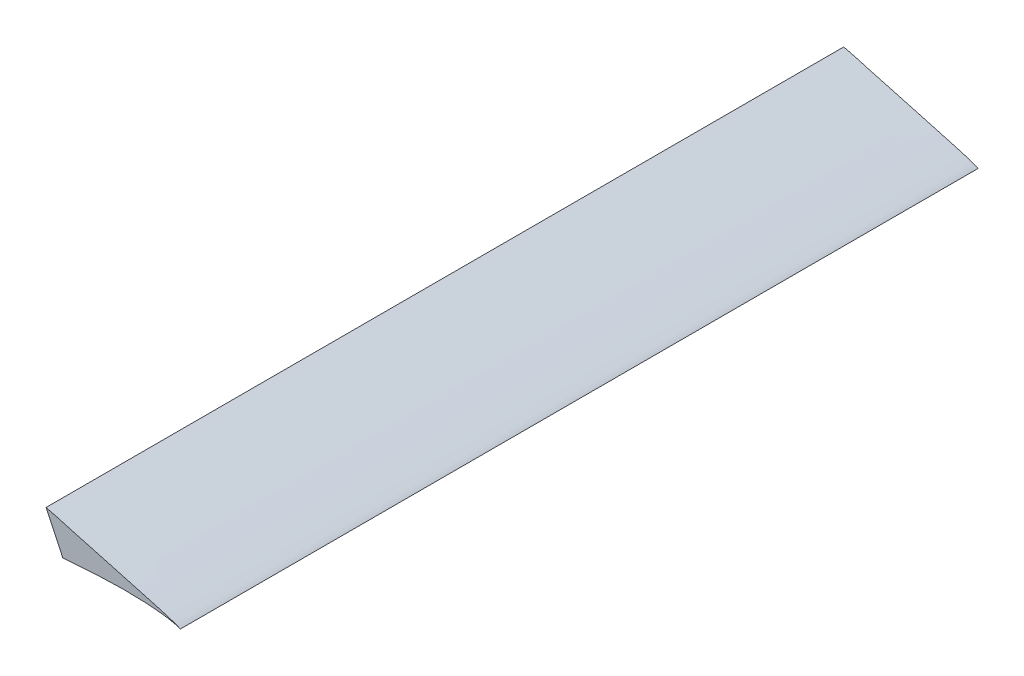
ISO-10303-21;
HEADER;
FILE_DESCRIPTION(('STEP AP214'),'2;1');
FILE_NAME('part.step','',(''),(''),'','','');
FILE_SCHEMA(('AUTOMOTIVE_DESIGN { 1 0 10303 214 1 1 1 1 }'));
ENDSEC;
DATA;
#1=APPLICATION_CONTEXT('core data for automotive mechanical design processes');
#2=APPLICATION_PROTOCOL_DEFINITION('international standard','automotive_design',2000,#1);
#3=PRODUCT_CONTEXT('',#1,'mechanical');
#4=PRODUCT('Part','Part','',(#3));
#5=PRODUCT_RELATED_PRODUCT_CATEGORY('part','',(#4));
#6=PRODUCT_DEFINITION_FORMATION('','',#4);
#7=PRODUCT_DEFINITION_CONTEXT('part definition',#1,'design');
#8=PRODUCT_DEFINITION('design','',#6,#7);
#9=PRODUCT_DEFINITION_SHAPE('','',#8);
#10=(LENGTH_UNIT() NAMED_UNIT(*) SI_UNIT(.MILLI.,.METRE.));
#11=(NAMED_UNIT(*) PLANE_ANGLE_UNIT() SI_UNIT($,.RADIAN.));
#12=(NAMED_UNIT(*) SI_UNIT($,.STERADIAN.) SOLID_ANGLE_UNIT());
#13=UNCERTAINTY_MEASURE_WITH_UNIT(LENGTH_MEASURE(1.E-05),#10,'distance_accuracy_value','');
#14=(GEOMETRIC_REPRESENTATION_CONTEXT(3) GLOBAL_UNCERTAINTY_ASSIGNED_CONTEXT((#13)) GLOBAL_UNIT_ASSIGNED_CONTEXT((#10,
#11,#12)) REPRESENTATION_CONTEXT('',''));
#15=CARTESIAN_POINT('',(0.,0.,0.));
#16=DIRECTION('',(0.,0.,1.));
#17=DIRECTION('',(1.,0.,0.));
#18=AXIS2_PLACEMENT_3D('',#15,#16,#17);
#19=CARTESIAN_POINT('',(252.080803760384,120.091997464376,754.38));
#20=DIRECTION('',(0.902786104260496,0.430089816147927,0.));
#21=DIRECTION('',(-0.430089816147927,0.902786104260496,0.));
#22=AXIS2_PLACEMENT_3D('',#19,#20,#21);
#23=PLANE('',#22);
#24=DIRECTION('',(0.430089816147927,-0.902786104260496,0.));
#25=VECTOR('',#24,1.);
#26=CARTESIAN_POINT('',(252.080803760384,120.091997464376,0.));
#27=LINE('',#26,#25);
#28=CARTESIAN_POINT('',(292.1,36.0891382653728,0.));
#29=VERTEX_POINT('',#28);
#30=CARTESIAN_POINT('',(307.975,2.76649525676335,0.));
#31=VERTEX_POINT('',#30);
#32=EDGE_CURVE('E74',#29,#31,#27,.T.);
#33=ORIENTED_EDGE('',*,*,#32,.T.);
#34=DIRECTION('',(0.,0.,-1.));
#35=VECTOR('',#34,1.);
#36=CARTESIAN_POINT('',(307.975,2.76649525676335,754.38));
#37=LINE('',#36,#35);
#38=CARTESIAN_POINT('',(307.975,2.76649525676335,754.38));
#39=VERTEX_POINT('',#38);
#40=EDGE_CURVE('E11',#39,#31,#37,.T.);
#41=ORIENTED_EDGE('',*,*,#40,.F.);
#42=DIRECTION('',(0.430089816147927,-0.902786104260496,0.));
#43=VECTOR('',#42,1.);
#44=CARTESIAN_POINT('',(252.080803760384,120.091997464376,754.38));
#45=LINE('',#44,#43);
#46=CARTESIAN_POINT('',(292.1,36.0891382653728,754.38));
#47=VERTEX_POINT('',#46);
#48=EDGE_CURVE('E73',#47,#39,#45,.T.);
#49=ORIENTED_EDGE('',*,*,#48,.F.);
#50=DIRECTION('',(0.,0.,-1.));
#51=VECTOR('',#50,1.);
#52=CARTESIAN_POINT('',(292.1,36.0891382653728,754.38));
#53=LINE('',#52,#51);
#54=EDGE_CURVE('E50',#47,#29,#53,.T.);
#55=ORIENTED_EDGE('',*,*,#54,.T.);
#56=EDGE_LOOP('',(#33,#41,#49,#55));
#57=FACE_BOUND('',#56,.T.);
#58=ADVANCED_FACE('F41',(#57),#23,.F.);
#59=CARTESIAN_POINT('',(419.1,0.,754.38));
#60=CARTESIAN_POINT('',(419.135582715604,0.0308317196044877,754.38));
#61=CARTESIAN_POINT('',(415.908005576762,1.68017552922438,754.38));
#62=CARTESIAN_POINT('',(413.243760321431,2.45449325102642,754.38));
#63=CARTESIAN_POINT('',(409.043286393216,3.88399929072975,754.38));
#64=CARTESIAN_POINT('',(404.448084399841,5.26468352260066,754.38));
#65=CARTESIAN_POINT('',(399.073048504437,6.84672085309653,754.38));
#66=CARTESIAN_POINT('',(393.069943473864,8.55383071372093,754.38));
#67=CARTESIAN_POINT('',(386.416537762572,10.4125623702694,754.38));
#68=CARTESIAN_POINT('',(379.149346257583,12.4152401973134,754.38));
#69=CARTESIAN_POINT('',(371.290373604248,14.5663386528226,754.38));
#70=CARTESIAN_POINT('',(362.867607833606,16.8600771410093,754.38));
#71=CARTESIAN_POINT('',(353.911264701423,19.2970964213392,754.38));
#72=CARTESIAN_POINT('',(344.453150457147,21.8730071850554,754.38));
#73=CARTESIAN_POINT('',(334.523432326998,24.5698824655877,754.38));
#74=CARTESIAN_POINT('',(324.169303454509,27.4216021936468,754.38));
#75=CARTESIAN_POINT('',(313.362731470659,30.2499142733887,754.38));
#76=CARTESIAN_POINT('',(302.362905014892,33.694567181203,754.38));
#77=CARTESIAN_POINT('',(290.812066152157,36.3225036594668,754.38));
#78=CARTESIAN_POINT('',(279.147802785444,39.4898304897028,754.38));
#79=CARTESIAN_POINT('',(267.18702760258,42.4092459803584,754.38));
#80=CARTESIAN_POINT('',(255.034690470087,45.1684284186771,754.38));
#81=CARTESIAN_POINT('',(242.721185390446,47.650209376373,754.38));
#82=CARTESIAN_POINT('',(230.296228943543,49.8338945911509,754.38));
#83=CARTESIAN_POINT('',(217.801864374593,51.6800065771285,754.38));
#84=CARTESIAN_POINT('',(205.28400048705,53.175668630729,754.38));
#85=CARTESIAN_POINT('',(192.786307767397,54.3071055161748,754.38));
#86=CARTESIAN_POINT('',(180.35248832563,55.0551537512211,754.38));
#87=CARTESIAN_POINT('',(168.027001927048,55.4190185344547,754.38));
#88=CARTESIAN_POINT('',(155.853682433519,55.4157048874246,754.38));
#89=CARTESIAN_POINT('',(143.874848820048,55.0431886057995,754.38));
#90=CARTESIAN_POINT('',(132.132886757781,54.3128726201629,754.38));
#91=CARTESIAN_POINT('',(120.667074019597,53.2411304735398,754.38));
#92=CARTESIAN_POINT('',(109.522615963792,51.8022144959764,754.38));
#93=CARTESIAN_POINT('',(98.7372141186955,50.0463241889842,754.38));
#94=CARTESIAN_POINT('',(88.3471013961049,48.018984454137,754.38));
#95=CARTESIAN_POINT('',(78.3889033747344,45.7522950434563,754.38));
#96=CARTESIAN_POINT('',(68.8976027410483,43.2760726247493,754.38));
#97=CARTESIAN_POINT('',(59.9067725274482,40.6169839418443,754.38));
#98=CARTESIAN_POINT('',(51.4478081121291,37.8028434738782,754.38));
#99=CARTESIAN_POINT('',(43.5499195166549,34.8620258650089,754.38));
#100=CARTESIAN_POINT('',(36.2412767191211,31.8209315950195,754.38));
#101=CARTESIAN_POINT('',(29.5472205514253,28.7079086552229,754.38));
#102=CARTESIAN_POINT('',(23.4899755011858,25.5532333371454,754.38));
#103=CARTESIAN_POINT('',(18.0911782238622,22.3841442181796,754.38));
#104=CARTESIAN_POINT('',(13.3658843805296,19.2305326996037,754.38));
#105=CARTESIAN_POINT('',(9.3302502078457,16.1138179845186,754.38));
#106=CARTESIAN_POINT('',(5.96985195064272,13.0389997626468,754.38));
#107=CARTESIAN_POINT('',(3.34519775435926,9.93858431084437,754.38));
#108=CARTESIAN_POINT('',(1.18019279694968,6.53570814186339,754.38));
#109=CARTESIAN_POINT('',(0.479614476084666,3.07990840614629,754.38));
#110=CARTESIAN_POINT('',(-0.173094538194013,-0.266173519096999,754.38));
#111=CARTESIAN_POINT('',(0.240253696731487,-3.33294292892219,754.38));
#112=CARTESIAN_POINT('',(1.37823066344816,-6.42381349893486,754.38));
#113=CARTESIAN_POINT('',(3.22917605316422,-9.15021189114401,754.38));
#114=CARTESIAN_POINT('',(5.89603945867697,-11.3206783893859,754.38));
#115=CARTESIAN_POINT('',(9.37076014042797,-12.5914230643237,754.38));
#116=CARTESIAN_POINT('',(13.453435798726,-13.2083059619907,754.38));
#117=CARTESIAN_POINT('',(18.1779423005279,-13.5437135880216,754.38));
#118=CARTESIAN_POINT('',(23.5691170669731,-13.7123319803595,754.38));
#119=CARTESIAN_POINT('',(29.6182619801359,-13.823243232534,754.38));
#120=CARTESIAN_POINT('',(36.3042180587839,-13.6335103430087,754.38));
#121=CARTESIAN_POINT('',(43.6073655350185,-13.7495169210751,754.38));
#122=CARTESIAN_POINT('',(51.4990776759717,-13.5704792834039,754.38));
#123=CARTESIAN_POINT('',(59.9532183473222,-13.4254465725169,754.38));
#124=CARTESIAN_POINT('',(68.9395115321997,-13.2237173628326,754.38));
#125=CARTESIAN_POINT('',(78.4265430004961,-12.9981677083409,754.38));
#126=CARTESIAN_POINT('',(88.3808800346853,-12.7416794666378,754.38));
#127=CARTESIAN_POINT('',(98.7673540895394,-12.4570310641555,754.38));
#128=CARTESIAN_POINT('',(109.54948172432,-12.140459652531,754.38));
#129=CARTESIAN_POINT('',(120.689292624668,-11.7887582713286,754.38));
#130=CARTESIAN_POINT('',(132.147836588957,-11.3961109222143,754.38));
#131=CARTESIAN_POINT('',(143.884459540584,-10.9535138146728,754.38));
#132=CARTESIAN_POINT('',(155.858263106315,-10.4528030476575,754.38));
#133=CARTESIAN_POINT('',(168.027206140478,-9.86999068905553,754.38));
#134=CARTESIAN_POINT('',(180.347887972849,-9.165777546511,754.38));
#135=CARTESIAN_POINT('',(192.776520036076,-8.32898473292583,754.38));
#136=CARTESIAN_POINT('',(205.26997993133,-7.36712520311923,754.38));
#137=CARTESIAN_POINT('',(217.78370517201,-6.28359723526979,754.38));
#138=CARTESIAN_POINT('',(230.27340567155,-5.08810592291552,754.38));
#139=CARTESIAN_POINT('',(242.694431579561,-3.80572861400042,754.38));
#140=CARTESIAN_POINT('',(255.00369846204,-2.48473779902352,754.38));
#141=CARTESIAN_POINT('',(267.1595145786,-1.18392896216685,754.38));
#142=CARTESIAN_POINT('',(279.118910189508,0.0608541103189656,754.38));
#143=CARTESIAN_POINT('',(290.839416131453,1.22547415877869,754.38));
#144=CARTESIAN_POINT('',(302.279388868877,2.28931437619538,754.38));
#145=CARTESIAN_POINT('',(313.398970817434,3.22922123297632,754.38));
#146=CARTESIAN_POINT('',(324.158839538699,4.03315524687126,754.38));
#147=CARTESIAN_POINT('',(334.521417810108,4.68459136287556,754.38));
#148=CARTESIAN_POINT('',(344.449906703923,5.17915941725161,754.38));
#149=CARTESIAN_POINT('',(353.909457193007,5.50145282981024,754.38));
#150=CARTESIAN_POINT('',(362.866468874944,5.68255660990501,754.38));
#151=CARTESIAN_POINT('',(371.289861146006,5.66136185236058,754.38));
#152=CARTESIAN_POINT('',(379.150044793554,5.50730755128629,754.38));
#153=CARTESIAN_POINT('',(386.41801209807,5.19545299038324,754.38));
#154=CARTESIAN_POINT('',(393.072269135646,4.74663009471408,754.38));
#155=CARTESIAN_POINT('',(399.076807101172,4.17945925926168,754.38));
#156=CARTESIAN_POINT('',(404.450455267835,3.48998403896945,754.38));
#157=CARTESIAN_POINT('',(409.051278482858,2.78398441205405,754.38));
#158=CARTESIAN_POINT('',(413.236952463653,1.83700723232058,754.38));
#159=CARTESIAN_POINT('',(415.921101733839,1.37110704301137,754.38));
#160=CARTESIAN_POINT('',(419.065830525278,-0.029607174319721,754.38));
#161=CARTESIAN_POINT('',(419.1,0.,754.38));
#162=B_SPLINE_CURVE_WITH_KNOTS('',3,(#59,#60,#61,#62,#63,#64,#65,#66,#67,#68,#69,#70,#71,#72,
#73,#74,#75,#76,#77,#78,#79,#80,#81,#82,#83,#84,#85,#86,#87,#88,#89,#90,#91,#92,#93,#94,#95,#96,
#97,#98,#99,#100,#101,#102,#103,#104,#105,#106,#107,#108,#109,#110,#111,#112,#113,#114,#115,
#116,#117,#118,#119,#120,#121,#122,#123,#124,#125,#126,#127,#128,#129,#130,#131,#132,#133,#134,
#135,#136,#137,#138,#139,#140,#141,#142,#143,#144,#145,#146,#147,#148,#149,#150,#151,#152,#153,
#154,#155,#156,#157,#158,#159,#160,#161),.UNSPECIFIED.,.T.,.F.,(4,1,1,1,1,1,1,1,1,1,1,1,1,1,1,1,
1,1,1,1,1,1,1,1,1,1,1,1,1,1,1,1,1,1,1,1,1,1,1,1,1,1,1,1,1,1,1,1,1,1,1,1,1,1,1,1,1,1,1,1,1,1,1,1,
1,1,1,1,1,1,1,1,1,1,1,1,1,1,1,1,1,1,1,1,1,1,1,1,1,1,1,1,1,1,1,1,1,1,1,1,4),(0.,
0.00326326473849562,0.00725055778081695,0.0120517866669423,0.0176623330327685,
0.0240683135255837,0.0312496964611172,0.0391846495195136,0.0478476383038653,0.0572106956853794,
0.0672423330052171,0.0779087597757613,0.0891739845115157,0.100998598535301,0.113341295445461,
0.126157183269471,0.139462308480939,0.15301104004999,0.166927614873976,0.181081999654676,
0.195404479567021,0.209838051098696,0.22433260533195,0.238841948726956,0.253325072610518,
0.267739981910177,0.282048685133404,0.296212776873056,0.310196042923521,0.323962314217842,
0.337476234648746,0.350702494836571,0.363610632106416,0.376163958841249,0.388325705275646,
0.400058825783343,0.411327389676265,0.422098222191528,0.43233946020634,0.442020270803025,
0.451113162537921,0.459592207108775,0.467434958693347,0.474622153537792,0.481140130111015,
0.486983093720853,0.492171114209171,0.496782496001346,0.500970225910245,0.505871632390465,
0.508789423353898,0.512670174112342,0.516325667709443,0.520069901737776,0.523879651231969,
0.52796074283848,0.532641784179838,0.53806925539385,0.544264221299989,0.551214848194982,
0.558899644744671,0.567291448215615,0.576362098792024,0.586079537161936,0.59640911206805,
0.607314709370189,0.618758331538551,0.630699137504577,0.643094929182506,0.655903572744297,
0.669079202119925,0.682576600267353,0.696348372587692,0.710348009169474,0.724529115657972,
0.738844326830719,0.753243364933569,0.767678182352391,0.782097111011908,0.796448880119002,
0.810678262943487,0.824728612910585,0.838547558662397,0.852083943216766,0.865287848030887,
0.878111787127333,0.890511304117214,0.902443005266515,0.913865891429004,0.924742045614225,
0.935035830895632,0.944714495449492,0.953747111862331,0.962105881416277,0.969765452086777,
0.97670305026236,0.982898839006144,0.988333205705569,0.992993711919812,0.996866342545812,1.),.UNSPECIFIED.);
#163=DIRECTION('',(0.,0.,-1.));
#164=VECTOR('',#163,1.);
#165=SURFACE_OF_LINEAR_EXTRUSION('',#162,#164);
#166=CARTESIAN_POINT('',(419.1,0.,0.));
#167=CARTESIAN_POINT('',(419.135582715604,0.0308317196044877,0.));
#168=CARTESIAN_POINT('',(415.908005576762,1.68017552922438,0.));
#169=CARTESIAN_POINT('',(413.243760321431,2.45449325102642,0.));
#170=CARTESIAN_POINT('',(409.043286393216,3.88399929072975,0.));
#171=CARTESIAN_POINT('',(404.448084399841,5.26468352260066,0.));
#172=CARTESIAN_POINT('',(399.073048504437,6.84672085309653,0.));
#173=CARTESIAN_POINT('',(393.069943473864,8.55383071372093,0.));
#174=CARTESIAN_POINT('',(386.416537762572,10.4125623702694,0.));
#175=CARTESIAN_POINT('',(379.149346257583,12.4152401973134,0.));
#176=CARTESIAN_POINT('',(371.290373604248,14.5663386528226,0.));
#177=CARTESIAN_POINT('',(362.867607833606,16.8600771410093,0.));
#178=CARTESIAN_POINT('',(353.911264701423,19.2970964213392,0.));
#179=CARTESIAN_POINT('',(344.453150457147,21.8730071850554,0.));
#180=CARTESIAN_POINT('',(334.523432326998,24.5698824655877,0.));
#181=CARTESIAN_POINT('',(324.169303454509,27.4216021936468,0.));
#182=CARTESIAN_POINT('',(313.362731470659,30.2499142733887,0.));
#183=CARTESIAN_POINT('',(302.362905014892,33.694567181203,0.));
#184=CARTESIAN_POINT('',(290.812066152157,36.3225036594668,0.));
#185=CARTESIAN_POINT('',(279.147802785444,39.4898304897028,0.));
#186=CARTESIAN_POINT('',(267.18702760258,42.4092459803584,0.));
#187=CARTESIAN_POINT('',(255.034690470087,45.1684284186771,0.));
#188=CARTESIAN_POINT('',(242.721185390446,47.650209376373,0.));
#189=CARTESIAN_POINT('',(230.296228943543,49.8338945911509,0.));
#190=CARTESIAN_POINT('',(217.801864374593,51.6800065771285,0.));
#191=CARTESIAN_POINT('',(205.28400048705,53.175668630729,0.));
#192=CARTESIAN_POINT('',(192.786307767397,54.3071055161748,0.));
#193=CARTESIAN_POINT('',(180.35248832563,55.0551537512211,0.));
#194=CARTESIAN_POINT('',(168.027001927048,55.4190185344547,0.));
#195=CARTESIAN_POINT('',(155.853682433519,55.4157048874246,0.));
#196=CARTESIAN_POINT('',(143.874848820048,55.0431886057995,0.));
#197=CARTESIAN_POINT('',(132.132886757781,54.3128726201629,0.));
#198=CARTESIAN_POINT('',(120.667074019597,53.2411304735398,0.));
#199=CARTESIAN_POINT('',(109.522615963792,51.8022144959764,0.));
#200=CARTESIAN_POINT('',(98.7372141186955,50.0463241889842,0.));
#201=CARTESIAN_POINT('',(88.3471013961049,48.018984454137,0.));
#202=CARTESIAN_POINT('',(78.3889033747344,45.7522950434563,0.));
#203=CARTESIAN_POINT('',(68.8976027410483,43.2760726247493,0.));
#204=CARTESIAN_POINT('',(59.9067725274482,40.6169839418443,0.));
#205=CARTESIAN_POINT('',(51.4478081121291,37.8028434738782,0.));
#206=CARTESIAN_POINT('',(43.5499195166549,34.8620258650089,0.));
#207=CARTESIAN_POINT('',(36.2412767191211,31.8209315950195,0.));
#208=CARTESIAN_POINT('',(29.5472205514253,28.7079086552229,0.));
#209=CARTESIAN_POINT('',(23.4899755011858,25.5532333371454,0.));
#210=CARTESIAN_POINT('',(18.0911782238622,22.3841442181796,0.));
#211=CARTESIAN_POINT('',(13.3658843805296,19.2305326996037,0.));
#212=CARTESIAN_POINT('',(9.3302502078457,16.1138179845186,0.));
#213=CARTESIAN_POINT('',(5.96985195064272,13.0389997626468,0.));
#214=CARTESIAN_POINT('',(3.34519775435926,9.93858431084437,0.));
#215=CARTESIAN_POINT('',(1.18019279694968,6.53570814186339,0.));
#216=CARTESIAN_POINT('',(0.479614476084666,3.07990840614629,0.));
#217=CARTESIAN_POINT('',(-0.173094538194013,-0.266173519096999,0.));
#218=CARTESIAN_POINT('',(0.240253696731487,-3.33294292892219,0.));
#219=CARTESIAN_POINT('',(1.37823066344816,-6.42381349893486,0.));
#220=CARTESIAN_POINT('',(3.22917605316422,-9.15021189114401,0.));
#221=CARTESIAN_POINT('',(5.89603945867697,-11.3206783893859,0.));
#222=CARTESIAN_POINT('',(9.37076014042797,-12.5914230643237,0.));
#223=CARTESIAN_POINT('',(13.453435798726,-13.2083059619907,0.));
#224=CARTESIAN_POINT('',(18.1779423005279,-13.5437135880216,0.));
#225=CARTESIAN_POINT('',(23.5691170669731,-13.7123319803595,0.));
#226=CARTESIAN_POINT('',(29.6182619801359,-13.823243232534,0.));
#227=CARTESIAN_POINT('',(36.3042180587839,-13.6335103430087,0.));
#228=CARTESIAN_POINT('',(43.6073655350185,-13.7495169210751,0.));
#229=CARTESIAN_POINT('',(51.4990776759717,-13.5704792834039,0.));
#230=CARTESIAN_POINT('',(59.9532183473222,-13.4254465725169,0.));
#231=CARTESIAN_POINT('',(68.9395115321997,-13.2237173628326,0.));
#232=CARTESIAN_POINT('',(78.4265430004961,-12.9981677083409,0.));
#233=CARTESIAN_POINT('',(88.3808800346853,-12.7416794666378,0.));
#234=CARTESIAN_POINT('',(98.7673540895394,-12.4570310641555,0.));
#235=CARTESIAN_POINT('',(109.54948172432,-12.140459652531,0.));
#236=CARTESIAN_POINT('',(120.689292624668,-11.7887582713286,0.));
#237=CARTESIAN_POINT('',(132.147836588957,-11.3961109222143,0.));
#238=CARTESIAN_POINT('',(143.884459540584,-10.9535138146728,0.));
#239=CARTESIAN_POINT('',(155.858263106315,-10.4528030476575,0.));
#240=CARTESIAN_POINT('',(168.027206140478,-9.86999068905553,0.));
#241=CARTESIAN_POINT('',(180.347887972849,-9.165777546511,0.));
#242=CARTESIAN_POINT('',(192.776520036076,-8.32898473292583,0.));
#243=CARTESIAN_POINT('',(205.26997993133,-7.36712520311923,0.));
#244=CARTESIAN_POINT('',(217.78370517201,-6.28359723526979,0.));
#245=CARTESIAN_POINT('',(230.27340567155,-5.08810592291552,0.));
#246=CARTESIAN_POINT('',(242.694431579561,-3.80572861400042,0.));
#247=CARTESIAN_POINT('',(255.00369846204,-2.48473779902352,0.));
#248=CARTESIAN_POINT('',(267.1595145786,-1.18392896216685,0.));
#249=CARTESIAN_POINT('',(279.118910189508,0.0608541103189656,0.));
#250=CARTESIAN_POINT('',(290.839416131453,1.22547415877869,0.));
#251=CARTESIAN_POINT('',(302.279388868877,2.28931437619538,0.));
#252=CARTESIAN_POINT('',(313.398970817434,3.22922123297632,0.));
#253=CARTESIAN_POINT('',(324.158839538699,4.03315524687126,0.));
#254=CARTESIAN_POINT('',(334.521417810108,4.68459136287556,0.));
#255=CARTESIAN_POINT('',(344.449906703923,5.17915941725161,0.));
#256=CARTESIAN_POINT('',(353.909457193007,5.50145282981024,0.));
#257=CARTESIAN_POINT('',(362.866468874944,5.68255660990501,0.));
#258=CARTESIAN_POINT('',(371.289861146006,5.66136185236058,0.));
#259=CARTESIAN_POINT('',(379.150044793554,5.50730755128629,0.));
#260=CARTESIAN_POINT('',(386.41801209807,5.19545299038324,0.));
#261=CARTESIAN_POINT('',(393.072269135646,4.74663009471408,0.));
#262=CARTESIAN_POINT('',(399.076807101172,4.17945925926168,0.));
#263=CARTESIAN_POINT('',(404.450455267835,3.48998403896945,0.));
#264=CARTESIAN_POINT('',(409.051278482858,2.78398441205405,0.));
#265=CARTESIAN_POINT('',(413.236952463653,1.83700723232058,0.));
#266=CARTESIAN_POINT('',(415.921101733839,1.37110704301137,0.));
#267=CARTESIAN_POINT('',(419.065830525278,-0.029607174319721,0.));
#268=CARTESIAN_POINT('',(419.1,0.,0.));
#269=B_SPLINE_CURVE_WITH_KNOTS('',3,(#166,#167,#168,#169,#170,#171,#172,#173,#174,#175,#176,
#177,#178,#179,#180,#181,#182,#183,#184,#185,#186,#187,#188,#189,#190,#191,#192,#193,#194,#195,
#196,#197,#198,#199,#200,#201,#202,#203,#204,#205,#206,#207,#208,#209,#210,#211,#212,#213,#214,
#215,#216,#217,#218,#219,#220,#221,#222,#223,#224,#225,#226,#227,#228,#229,#230,#231,#232,#233,
#234,#235,#236,#237,#238,#239,#240,#241,#242,#243,#244,#245,#246,#247,#248,#249,#250,#251,#252,
#253,#254,#255,#256,#257,#258,#259,#260,#261,#262,#263,#264,#265,#266,#267,#268),.UNSPECIFIED.,
.T.,.F.,(4,1,1,1,1,1,1,1,1,1,1,1,1,1,1,1,1,1,1,1,1,1,1,1,1,1,1,1,1,1,1,1,1,1,1,1,1,1,1,1,1,1,1,
1,1,1,1,1,1,1,1,1,1,1,1,1,1,1,1,1,1,1,1,1,1,1,1,1,1,1,1,1,1,1,1,1,1,1,1,1,1,1,1,1,1,1,1,1,1,1,1,
1,1,1,1,1,1,1,1,1,4),(0.,0.00326326473849562,0.00725055778081695,0.0120517866669423,
0.0176623330327685,0.0240683135255837,0.0312496964611172,0.0391846495195136,0.0478476383038653,
0.0572106956853794,0.0672423330052171,0.0779087597757613,0.0891739845115157,0.100998598535301,
0.113341295445461,0.126157183269471,0.139462308480939,0.15301104004999,0.166927614873976,
0.181081999654676,0.195404479567021,0.209838051098696,0.22433260533195,0.238841948726956,
0.253325072610518,0.267739981910177,0.282048685133404,0.296212776873056,0.310196042923521,
0.323962314217842,0.337476234648746,0.350702494836571,0.363610632106416,0.376163958841249,
0.388325705275646,0.400058825783343,0.411327389676265,0.422098222191528,0.43233946020634,
0.442020270803025,0.451113162537921,0.459592207108775,0.467434958693347,0.474622153537792,
0.481140130111015,0.486983093720853,0.492171114209171,0.496782496001346,0.500970225910245,
0.505871632390465,0.508789423353898,0.512670174112342,0.516325667709443,0.520069901737776,
0.523879651231969,0.52796074283848,0.532641784179838,0.53806925539385,0.544264221299989,
0.551214848194982,0.558899644744671,0.567291448215615,0.576362098792024,0.586079537161936,
0.59640911206805,0.607314709370189,0.618758331538551,0.630699137504577,0.643094929182506,
0.655903572744297,0.669079202119925,0.682576600267353,0.696348372587692,0.710348009169474,
0.724529115657972,0.738844326830719,0.753243364933569,0.767678182352391,0.782097111011908,
0.796448880119002,0.810678262943487,0.824728612910585,0.838547558662397,0.852083943216766,
0.865287848030887,0.878111787127333,0.890511304117214,0.902443005266515,0.913865891429004,
0.924742045614225,0.935035830895632,0.944714495449492,0.953747111862331,0.962105881416277,
0.969765452086777,0.97670305026236,0.982898839006144,0.988333205705569,0.992993711919812,
0.996866342545812,1.),.UNSPECIFIED.);
#270=EDGE_CURVE('E65',#31,#29,#269,.T.);
#271=ORIENTED_EDGE('',*,*,#270,.T.);
#272=ORIENTED_EDGE('',*,*,#54,.F.);
#273=EDGE_CURVE('E57',#39,#47,#162,.T.);
#274=ORIENTED_EDGE('',*,*,#273,.F.);
#275=ORIENTED_EDGE('',*,*,#40,.T.);
#276=EDGE_LOOP('',(#271,#272,#274,#275));
#277=FACE_BOUND('',#276,.T.);
#278=ADVANCED_FACE('F68',(#277),#165,.F.);
#279=CARTESIAN_POINT('',(0.,0.,754.38));
#280=DIRECTION('',(0.,0.,1.));
#281=DIRECTION('',(1.,0.,0.));
#282=AXIS2_PLACEMENT_3D('',#279,#280,#281);
#283=PLANE('',#282);
#284=ORIENTED_EDGE('',*,*,#48,.T.);
#285=ORIENTED_EDGE('',*,*,#273,.T.);
#286=EDGE_LOOP('',(#284,#285));
#287=FACE_BOUND('',#286,.T.);
#288=ADVANCED_FACE('F97',(#287),#283,.T.);
#289=CARTESIAN_POINT('',(0.,0.,0.));
#290=DIRECTION('',(0.,0.,1.));
#291=DIRECTION('',(1.,0.,0.));
#292=AXIS2_PLACEMENT_3D('',#289,#290,#291);
#293=PLANE('',#292);
#294=ORIENTED_EDGE('',*,*,#32,.F.);
#295=ORIENTED_EDGE('',*,*,#270,.F.);
#296=EDGE_LOOP('',(#294,#295));
#297=FACE_BOUND('',#296,.T.);
#298=ADVANCED_FACE('F78',(#297),#293,.F.);
#299=CLOSED_SHELL('',(#58,#278,#288,#298));
#300=MANIFOLD_SOLID_BREP('B2',#299);
#301=ADVANCED_BREP_SHAPE_REPRESENTATION('',(#18,#300),#14);
#302=SHAPE_DEFINITION_REPRESENTATION(#9,#301);
ENDSEC;
END-ISO-10303-21;
